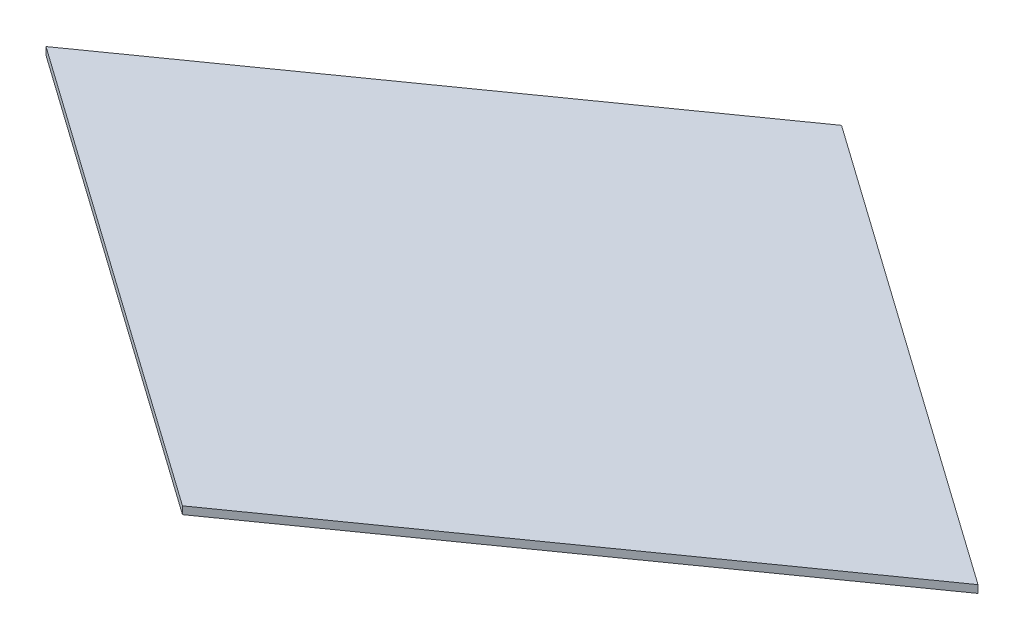
ISO-10303-21;
HEADER;
FILE_DESCRIPTION(('STEP AP214'),'2;1');
FILE_NAME('part.step','',(''),(''),'','','');
FILE_SCHEMA(('AUTOMOTIVE_DESIGN { 1 0 10303 214 1 1 1 1 }'));
ENDSEC;
DATA;
#1=APPLICATION_CONTEXT('core data for automotive mechanical design processes');
#2=APPLICATION_PROTOCOL_DEFINITION('international standard','automotive_design',2000,#1);
#3=PRODUCT_CONTEXT('',#1,'mechanical');
#4=PRODUCT('Part','Part','',(#3));
#5=PRODUCT_RELATED_PRODUCT_CATEGORY('part','',(#4));
#6=PRODUCT_DEFINITION_FORMATION('','',#4);
#7=PRODUCT_DEFINITION_CONTEXT('part definition',#1,'design');
#8=PRODUCT_DEFINITION('design','',#6,#7);
#9=PRODUCT_DEFINITION_SHAPE('','',#8);
#10=(LENGTH_UNIT() NAMED_UNIT(*) SI_UNIT(.MILLI.,.METRE.));
#11=(NAMED_UNIT(*) PLANE_ANGLE_UNIT() SI_UNIT($,.RADIAN.));
#12=(NAMED_UNIT(*) SI_UNIT($,.STERADIAN.) SOLID_ANGLE_UNIT());
#13=UNCERTAINTY_MEASURE_WITH_UNIT(LENGTH_MEASURE(1.E-05),#10,'distance_accuracy_value','');
#14=(GEOMETRIC_REPRESENTATION_CONTEXT(3) GLOBAL_UNCERTAINTY_ASSIGNED_CONTEXT((#13)) GLOBAL_UNIT_ASSIGNED_CONTEXT((#10,
#11,#12)) REPRESENTATION_CONTEXT('',''));
#15=CARTESIAN_POINT('',(0.,0.,0.));
#16=DIRECTION('',(0.,0.,1.));
#17=DIRECTION('',(1.,0.,0.));
#18=AXIS2_PLACEMENT_3D('',#15,#16,#17);
#19=CARTESIAN_POINT('',(0.,1.25,107.763073452829));
#20=DIRECTION('',(0.577350269189624,0.,-0.816496580927727));
#21=DIRECTION('',(-0.816496580927727,0.,-0.577350269189624));
#22=AXIS2_PLACEMENT_3D('',#19,#20,#21);
#23=PLANE('',#22);
#24=DIRECTION('',(0.816496580927727,0.,0.577350269189624));
#25=VECTOR('',#24,1.);
#26=CARTESIAN_POINT('',(0.,-1.25,107.763073452829));
#27=LINE('',#26,#25);
#28=CARTESIAN_POINT('',(-152.4,-1.25,0.));
#29=VERTEX_POINT('',#28);
#30=CARTESIAN_POINT('',(0.,-1.25,107.763073452829));
#31=VERTEX_POINT('',#30);
#32=EDGE_CURVE('E96',#29,#31,#27,.T.);
#33=ORIENTED_EDGE('',*,*,#32,.T.);
#34=DIRECTION('',(0.,-1.,0.));
#35=VECTOR('',#34,1.);
#36=CARTESIAN_POINT('',(0.,1.25,107.763073452829));
#37=LINE('',#36,#35);
#38=CARTESIAN_POINT('',(0.,1.25,107.763073452829));
#39=VERTEX_POINT('',#38);
#40=EDGE_CURVE('E11',#39,#31,#37,.T.);
#41=ORIENTED_EDGE('',*,*,#40,.F.);
#42=DIRECTION('',(0.816496580927727,0.,0.577350269189624));
#43=VECTOR('',#42,1.);
#44=CARTESIAN_POINT('',(0.,1.25,107.763073452829));
#45=LINE('',#44,#43);
#46=CARTESIAN_POINT('',(-152.4,1.25,0.));
#47=VERTEX_POINT('',#46);
#48=EDGE_CURVE('E84',#47,#39,#45,.T.);
#49=ORIENTED_EDGE('',*,*,#48,.F.);
#50=DIRECTION('',(0.,-1.,0.));
#51=VECTOR('',#50,1.);
#52=CARTESIAN_POINT('',(-152.4,1.25,0.));
#53=LINE('',#52,#51);
#54=EDGE_CURVE('E92',#47,#29,#53,.T.);
#55=ORIENTED_EDGE('',*,*,#54,.T.);
#56=EDGE_LOOP('',(#33,#41,#49,#55));
#57=FACE_BOUND('',#56,.T.);
#58=ADVANCED_FACE('F33',(#57),#23,.F.);
#59=CARTESIAN_POINT('',(152.4,1.25,0.));
#60=DIRECTION('',(-0.577350269189624,0.,-0.816496580927727));
#61=DIRECTION('',(-0.816496580927727,0.,0.577350269189624));
#62=AXIS2_PLACEMENT_3D('',#59,#60,#61);
#63=PLANE('',#62);
#64=DIRECTION('',(0.816496580927727,0.,-0.577350269189624));
#65=VECTOR('',#64,1.);
#66=CARTESIAN_POINT('',(152.4,-1.25,0.));
#67=LINE('',#66,#65);
#68=CARTESIAN_POINT('',(152.4,-1.25,0.));
#69=VERTEX_POINT('',#68);
#70=EDGE_CURVE('E88',#31,#69,#67,.T.);
#71=ORIENTED_EDGE('',*,*,#70,.T.);
#72=DIRECTION('',(0.,-1.,0.));
#73=VECTOR('',#72,1.);
#74=CARTESIAN_POINT('',(152.4,1.25,0.));
#75=LINE('',#74,#73);
#76=CARTESIAN_POINT('',(152.4,1.25,0.));
#77=VERTEX_POINT('',#76);
#78=EDGE_CURVE('E41',#77,#69,#75,.T.);
#79=ORIENTED_EDGE('',*,*,#78,.F.);
#80=DIRECTION('',(0.816496580927727,0.,-0.577350269189624));
#81=VECTOR('',#80,1.);
#82=CARTESIAN_POINT('',(152.4,1.25,0.));
#83=LINE('',#82,#81);
#84=EDGE_CURVE('E79',#39,#77,#83,.T.);
#85=ORIENTED_EDGE('',*,*,#84,.F.);
#86=ORIENTED_EDGE('',*,*,#40,.T.);
#87=EDGE_LOOP('',(#71,#79,#85,#86));
#88=FACE_BOUND('',#87,.T.);
#89=ADVANCED_FACE('F87',(#88),#63,.F.);
#90=CARTESIAN_POINT('',(0.,1.25,-107.763073452829));
#91=DIRECTION('',(-0.577350269189624,0.,0.816496580927727));
#92=DIRECTION('',(0.816496580927727,0.,0.577350269189624));
#93=AXIS2_PLACEMENT_3D('',#90,#91,#92);
#94=PLANE('',#93);
#95=DIRECTION('',(-0.816496580927727,0.,-0.577350269189624));
#96=VECTOR('',#95,1.);
#97=CARTESIAN_POINT('',(0.,-1.25,-107.763073452829));
#98=LINE('',#97,#96);
#99=CARTESIAN_POINT('',(0.,-1.25,-107.763073452829));
#100=VERTEX_POINT('',#99);
#101=EDGE_CURVE('E66',#69,#100,#98,.T.);
#102=ORIENTED_EDGE('',*,*,#101,.T.);
#103=DIRECTION('',(0.,-1.,0.));
#104=VECTOR('',#103,1.);
#105=CARTESIAN_POINT('',(0.,1.25,-107.763073452829));
#106=LINE('',#105,#104);
#107=CARTESIAN_POINT('',(0.,1.25,-107.763073452829));
#108=VERTEX_POINT('',#107);
#109=EDGE_CURVE('E89',#108,#100,#106,.T.);
#110=ORIENTED_EDGE('',*,*,#109,.F.);
#111=DIRECTION('',(-0.816496580927727,0.,-0.577350269189624));
#112=VECTOR('',#111,1.);
#113=CARTESIAN_POINT('',(0.,1.25,-107.763073452829));
#114=LINE('',#113,#112);
#115=EDGE_CURVE('E82',#77,#108,#114,.T.);
#116=ORIENTED_EDGE('',*,*,#115,.F.);
#117=ORIENTED_EDGE('',*,*,#78,.T.);
#118=EDGE_LOOP('',(#102,#110,#116,#117));
#119=FACE_BOUND('',#118,.T.);
#120=ADVANCED_FACE('F90',(#119),#94,.F.);
#121=CARTESIAN_POINT('',(-152.4,1.25,0.));
#122=DIRECTION('',(0.577350269189624,0.,0.816496580927727));
#123=DIRECTION('',(0.816496580927727,0.,-0.577350269189624));
#124=AXIS2_PLACEMENT_3D('',#121,#122,#123);
#125=PLANE('',#124);
#126=DIRECTION('',(-0.816496580927727,0.,0.577350269189624));
#127=VECTOR('',#126,1.);
#128=CARTESIAN_POINT('',(-152.4,-1.25,0.));
#129=LINE('',#128,#127);
#130=EDGE_CURVE('E72',#100,#29,#129,.T.);
#131=ORIENTED_EDGE('',*,*,#130,.T.);
#132=ORIENTED_EDGE('',*,*,#54,.F.);
#133=DIRECTION('',(-0.816496580927727,0.,0.577350269189624));
#134=VECTOR('',#133,1.);
#135=CARTESIAN_POINT('',(-152.4,1.25,0.));
#136=LINE('',#135,#134);
#137=EDGE_CURVE('E49',#108,#47,#136,.T.);
#138=ORIENTED_EDGE('',*,*,#137,.F.);
#139=ORIENTED_EDGE('',*,*,#109,.T.);
#140=EDGE_LOOP('',(#131,#132,#138,#139));
#141=FACE_BOUND('',#140,.T.);
#142=ADVANCED_FACE('F103',(#141),#125,.F.);
#143=CARTESIAN_POINT('',(0.,1.25,0.));
#144=DIRECTION('',(0.,-1.,0.));
#145=DIRECTION('',(0.,0.,-1.));
#146=AXIS2_PLACEMENT_3D('',#143,#144,#145);
#147=PLANE('',#146);
#148=ORIENTED_EDGE('',*,*,#48,.T.);
#149=ORIENTED_EDGE('',*,*,#84,.T.);
#150=ORIENTED_EDGE('',*,*,#115,.T.);
#151=ORIENTED_EDGE('',*,*,#137,.T.);
#152=EDGE_LOOP('',(#148,#149,#150,#151));
#153=FACE_BOUND('',#152,.T.);
#154=ADVANCED_FACE('F80',(#153),#147,.F.);
#155=CARTESIAN_POINT('',(0.,-1.25,0.));
#156=DIRECTION('',(0.,-1.,0.));
#157=DIRECTION('',(0.,0.,-1.));
#158=AXIS2_PLACEMENT_3D('',#155,#156,#157);
#159=PLANE('',#158);
#160=ORIENTED_EDGE('',*,*,#32,.F.);
#161=ORIENTED_EDGE('',*,*,#130,.F.);
#162=ORIENTED_EDGE('',*,*,#101,.F.);
#163=ORIENTED_EDGE('',*,*,#70,.F.);
#164=EDGE_LOOP('',(#160,#161,#162,#163));
#165=FACE_BOUND('',#164,.T.);
#166=ADVANCED_FACE('F106',(#165),#159,.T.);
#167=CLOSED_SHELL('',(#58,#89,#120,#142,#154,#166));
#168=MANIFOLD_SOLID_BREP('B2',#167);
#169=ADVANCED_BREP_SHAPE_REPRESENTATION('',(#18,#168),#14);
#170=SHAPE_DEFINITION_REPRESENTATION(#9,#169);
ENDSEC;
END-ISO-10303-21;
